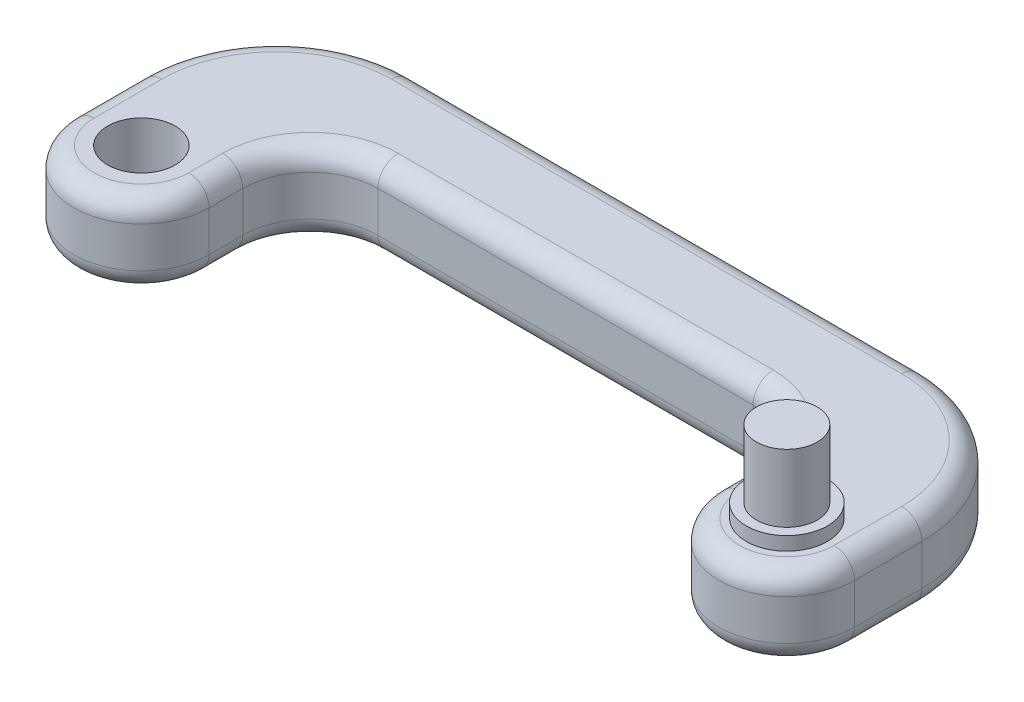
ISO-10303-21;
HEADER;
FILE_DESCRIPTION(('STEP AP214'),'2;1');
FILE_NAME('part.step','',(''),(''),'','','');
FILE_SCHEMA(('AUTOMOTIVE_DESIGN { 1 0 10303 214 1 1 1 1 }'));
ENDSEC;
DATA;
#1=APPLICATION_CONTEXT('core data for automotive mechanical design processes');
#2=APPLICATION_PROTOCOL_DEFINITION('international standard','automotive_design',2000,#1);
#3=PRODUCT_CONTEXT('',#1,'mechanical');
#4=PRODUCT('Part','Part','',(#3));
#5=PRODUCT_RELATED_PRODUCT_CATEGORY('part','',(#4));
#6=PRODUCT_DEFINITION_FORMATION('','',#4);
#7=PRODUCT_DEFINITION_CONTEXT('part definition',#1,'design');
#8=PRODUCT_DEFINITION('design','',#6,#7);
#9=PRODUCT_DEFINITION_SHAPE('','',#8);
#10=(LENGTH_UNIT() NAMED_UNIT(*) SI_UNIT(.MILLI.,.METRE.));
#11=(NAMED_UNIT(*) PLANE_ANGLE_UNIT() SI_UNIT($,.RADIAN.));
#12=(NAMED_UNIT(*) SI_UNIT($,.STERADIAN.) SOLID_ANGLE_UNIT());
#13=UNCERTAINTY_MEASURE_WITH_UNIT(LENGTH_MEASURE(1.E-05),#10,'distance_accuracy_value','');
#14=(GEOMETRIC_REPRESENTATION_CONTEXT(3) GLOBAL_UNCERTAINTY_ASSIGNED_CONTEXT((#13)) GLOBAL_UNIT_ASSIGNED_CONTEXT((#10,
#11,#12)) REPRESENTATION_CONTEXT('',''));
#15=CARTESIAN_POINT('',(0.,0.,0.));
#16=DIRECTION('',(0.,0.,1.));
#17=DIRECTION('',(1.,0.,0.));
#18=AXIS2_PLACEMENT_3D('',#15,#16,#17);
#19=CARTESIAN_POINT('',(-105.5,12.,0.));
#20=DIRECTION('',(-1.,0.,0.));
#21=DIRECTION('',(0.,0.,1.));
#22=AXIS2_PLACEMENT_3D('',#19,#20,#21);
#23=PLANE('',#22);
#24=DIRECTION('',(0.,-1.,0.));
#25=VECTOR('',#24,1.);
#26=CARTESIAN_POINT('',(-105.5,12.,0.));
#27=LINE('',#26,#25);
#28=CARTESIAN_POINT('',(-105.5,9.,0.));
#29=VERTEX_POINT('',#28);
#30=CARTESIAN_POINT('',(-105.5,3.,0.));
#31=VERTEX_POINT('',#30);
#32=EDGE_CURVE('E430',#29,#31,#27,.T.);
#33=ORIENTED_EDGE('',*,*,#32,.F.);
#34=DIRECTION('',(0.,0.,-1.));
#35=VECTOR('',#34,1.);
#36=CARTESIAN_POINT('',(-105.5,9.,0.));
#37=LINE('',#36,#35);
#38=CARTESIAN_POINT('',(-105.5,9.,-10.));
#39=VERTEX_POINT('',#38);
#40=EDGE_CURVE('E316',#29,#39,#37,.T.);
#41=ORIENTED_EDGE('',*,*,#40,.T.);
#42=DIRECTION('',(0.,-1.,0.));
#43=VECTOR('',#42,1.);
#44=CARTESIAN_POINT('',(-105.5,12.,-10.));
#45=LINE('',#44,#43);
#46=CARTESIAN_POINT('',(-105.5,3.,-10.));
#47=VERTEX_POINT('',#46);
#48=EDGE_CURVE('E238',#39,#47,#45,.T.);
#49=ORIENTED_EDGE('',*,*,#48,.T.);
#50=DIRECTION('',(0.,0.,-1.));
#51=VECTOR('',#50,1.);
#52=CARTESIAN_POINT('',(-105.5,3.,0.));
#53=LINE('',#52,#51);
#54=EDGE_CURVE('E313',#47,#31,#53,.F.);
#55=ORIENTED_EDGE('',*,*,#54,.T.);
#56=EDGE_LOOP('',(#33,#41,#49,#55));
#57=FACE_BOUND('',#56,.T.);
#58=ADVANCED_FACE('F36',(#57),#23,.T.);
#59=CARTESIAN_POINT('',(-95.5,12.,0.));
#60=DIRECTION('',(0.,-1.,0.));
#61=DIRECTION('',(0.,0.,-1.));
#62=AXIS2_PLACEMENT_3D('',#59,#60,#61);
#63=CYLINDRICAL_SURFACE('',#62,9.99999999999999);
#64=DIRECTION('',(0.,-1.,0.));
#65=VECTOR('',#64,1.);
#66=CARTESIAN_POINT('',(-85.5,12.,0.));
#67=LINE('',#66,#65);
#68=CARTESIAN_POINT('',(-85.5,9.,0.));
#69=VERTEX_POINT('',#68);
#70=CARTESIAN_POINT('',(-85.5,3.,0.));
#71=VERTEX_POINT('',#70);
#72=EDGE_CURVE('E426',#69,#71,#67,.T.);
#73=ORIENTED_EDGE('',*,*,#72,.F.);
#74=CARTESIAN_POINT('',(-95.5,9.,0.));
#75=DIRECTION('',(0.,1.,0.));
#76=DIRECTION('',(0.,0.,1.));
#77=AXIS2_PLACEMENT_3D('',#74,#75,#76);
#78=CIRCLE('',#77,9.99999999999999);
#79=EDGE_CURVE('E311',#69,#29,#78,.F.);
#80=ORIENTED_EDGE('',*,*,#79,.T.);
#81=ORIENTED_EDGE('',*,*,#32,.T.);
#82=CARTESIAN_POINT('',(-95.5,3.,0.));
#83=DIRECTION('',(0.,1.,0.));
#84=DIRECTION('',(0.,0.,1.));
#85=AXIS2_PLACEMENT_3D('',#82,#83,#84);
#86=CIRCLE('',#85,9.99999999999999);
#87=EDGE_CURVE('E309',#31,#71,#86,.T.);
#88=ORIENTED_EDGE('',*,*,#87,.T.);
#89=EDGE_LOOP('',(#73,#80,#81,#88));
#90=FACE_BOUND('',#89,.T.);
#91=ADVANCED_FACE('F473',(#90),#63,.T.);
#92=CARTESIAN_POINT('',(-85.5,12.,0.));
#93=DIRECTION('',(-1.,0.,0.));
#94=DIRECTION('',(0.,0.,1.));
#95=AXIS2_PLACEMENT_3D('',#92,#93,#94);
#96=PLANE('',#95);
#97=DIRECTION('',(0.,-1.,0.));
#98=VECTOR('',#97,1.);
#99=CARTESIAN_POINT('',(-85.5,12.,-5.));
#100=LINE('',#99,#98);
#101=CARTESIAN_POINT('',(-85.5,3.,-5.));
#102=VERTEX_POINT('',#101);
#103=CARTESIAN_POINT('',(-85.5,9.,-5.));
#104=VERTEX_POINT('',#103);
#105=EDGE_CURVE('E255',#102,#104,#100,.F.);
#106=ORIENTED_EDGE('',*,*,#105,.T.);
#107=DIRECTION('',(0.,0.,-1.));
#108=VECTOR('',#107,1.);
#109=CARTESIAN_POINT('',(-85.5,9.,0.));
#110=LINE('',#109,#108);
#111=EDGE_CURVE('E307',#104,#69,#110,.F.);
#112=ORIENTED_EDGE('',*,*,#111,.T.);
#113=ORIENTED_EDGE('',*,*,#72,.T.);
#114=DIRECTION('',(0.,0.,-1.));
#115=VECTOR('',#114,1.);
#116=CARTESIAN_POINT('',(-85.5,3.,0.));
#117=LINE('',#116,#115);
#118=EDGE_CURVE('E305',#71,#102,#117,.T.);
#119=ORIENTED_EDGE('',*,*,#118,.T.);
#120=EDGE_LOOP('',(#106,#112,#113,#119));
#121=FACE_BOUND('',#120,.T.);
#122=ADVANCED_FACE('F478',(#121),#96,.F.);
#123=CARTESIAN_POINT('',(0.,12.,-15.));
#124=DIRECTION('',(0.,0.,-1.));
#125=DIRECTION('',(-1.,0.,0.));
#126=AXIS2_PLACEMENT_3D('',#123,#124,#125);
#127=PLANE('',#126);
#128=DIRECTION('',(0.,-1.,0.));
#129=VECTOR('',#128,1.);
#130=CARTESIAN_POINT('',(-19.9999999999614,12.,-15.));
#131=LINE('',#130,#129);
#132=CARTESIAN_POINT('',(-19.9999999999614,3.,-15.));
#133=VERTEX_POINT('',#132);
#134=CARTESIAN_POINT('',(-19.9999999999614,9.,-15.));
#135=VERTEX_POINT('',#134);
#136=EDGE_CURVE('E252',#133,#135,#131,.F.);
#137=ORIENTED_EDGE('',*,*,#136,.T.);
#138=DIRECTION('',(1.,0.,0.));
#139=VECTOR('',#138,1.);
#140=CARTESIAN_POINT('',(-75.5,9.,-15.));
#141=LINE('',#140,#139);
#142=CARTESIAN_POINT('',(-75.5,9.,-15.));
#143=VERTEX_POINT('',#142);
#144=EDGE_CURVE('E299',#135,#143,#141,.F.);
#145=ORIENTED_EDGE('',*,*,#144,.T.);
#146=DIRECTION('',(0.,-1.,0.));
#147=VECTOR('',#146,1.);
#148=CARTESIAN_POINT('',(-75.5,0.,-15.));
#149=LINE('',#148,#147);
#150=CARTESIAN_POINT('',(-75.5,3.,-15.));
#151=VERTEX_POINT('',#150);
#152=EDGE_CURVE('E249',#143,#151,#149,.T.);
#153=ORIENTED_EDGE('',*,*,#152,.T.);
#154=DIRECTION('',(1.,0.,0.));
#155=VECTOR('',#154,1.);
#156=CARTESIAN_POINT('',(0.,3.,-15.));
#157=LINE('',#156,#155);
#158=EDGE_CURVE('E297',#151,#133,#157,.T.);
#159=ORIENTED_EDGE('',*,*,#158,.T.);
#160=EDGE_LOOP('',(#137,#145,#153,#159));
#161=FACE_BOUND('',#160,.T.);
#162=ADVANCED_FACE('F483',(#161),#127,.F.);
#163=CARTESIAN_POINT('',(-9.99999999996144,12.,0.));
#164=DIRECTION('',(-1.,0.,0.));
#165=DIRECTION('',(0.,0.,1.));
#166=AXIS2_PLACEMENT_3D('',#163,#164,#165);
#167=PLANE('',#166);
#168=DIRECTION('',(0.,-1.,0.));
#169=VECTOR('',#168,1.);
#170=CARTESIAN_POINT('',(-9.99999999996144,12.,0.));
#171=LINE('',#170,#169);
#172=CARTESIAN_POINT('',(-9.99999999996144,9.,0.));
#173=VERTEX_POINT('',#172);
#174=CARTESIAN_POINT('',(-9.99999999996144,3.,0.));
#175=VERTEX_POINT('',#174);
#176=EDGE_CURVE('E418',#173,#175,#171,.T.);
#177=ORIENTED_EDGE('',*,*,#176,.F.);
#178=DIRECTION('',(0.,0.,-1.));
#179=VECTOR('',#178,1.);
#180=CARTESIAN_POINT('',(-9.99999999996144,9.,0.));
#181=LINE('',#180,#179);
#182=CARTESIAN_POINT('',(-9.99999999996144,9.,-5.));
#183=VERTEX_POINT('',#182);
#184=EDGE_CURVE('E291',#173,#183,#181,.T.);
#185=ORIENTED_EDGE('',*,*,#184,.T.);
#186=DIRECTION('',(0.,-1.,0.));
#187=VECTOR('',#186,1.);
#188=CARTESIAN_POINT('',(-9.99999999996144,12.,-5.));
#189=LINE('',#188,#187);
#190=CARTESIAN_POINT('',(-9.99999999996144,3.,-5.));
#191=VERTEX_POINT('',#190);
#192=EDGE_CURVE('E246',#183,#191,#189,.T.);
#193=ORIENTED_EDGE('',*,*,#192,.T.);
#194=DIRECTION('',(0.,0.,-1.));
#195=VECTOR('',#194,1.);
#196=CARTESIAN_POINT('',(-9.99999999996144,3.,0.));
#197=LINE('',#196,#195);
#198=EDGE_CURVE('E289',#191,#175,#197,.F.);
#199=ORIENTED_EDGE('',*,*,#198,.T.);
#200=EDGE_LOOP('',(#177,#185,#193,#199));
#201=FACE_BOUND('',#200,.T.);
#202=ADVANCED_FACE('F417',(#201),#167,.T.);
#203=CARTESIAN_POINT('',(0.,12.,0.));
#204=DIRECTION('',(0.,-1.,0.));
#205=DIRECTION('',(0.,0.,-1.));
#206=AXIS2_PLACEMENT_3D('',#203,#204,#205);
#207=CYLINDRICAL_SURFACE('',#206,9.99999999996144);
#208=DIRECTION('',(0.,-1.,0.));
#209=VECTOR('',#208,1.);
#210=CARTESIAN_POINT('',(9.99999999996144,12.,0.));
#211=LINE('',#210,#209);
#212=CARTESIAN_POINT('',(9.99999999996144,9.,0.));
#213=VERTEX_POINT('',#212);
#214=CARTESIAN_POINT('',(9.99999999996144,3.,0.));
#215=VERTEX_POINT('',#214);
#216=EDGE_CURVE('E427',#213,#215,#211,.T.);
#217=ORIENTED_EDGE('',*,*,#216,.F.);
#218=CARTESIAN_POINT('',(0.,9.,0.));
#219=DIRECTION('',(0.,1.,0.));
#220=DIRECTION('',(0.,0.,1.));
#221=AXIS2_PLACEMENT_3D('',#218,#219,#220);
#222=CIRCLE('',#221,9.99999999996144);
#223=EDGE_CURVE('E287',#213,#173,#222,.F.);
#224=ORIENTED_EDGE('',*,*,#223,.T.);
#225=ORIENTED_EDGE('',*,*,#176,.T.);
#226=CARTESIAN_POINT('',(0.,3.,0.));
#227=DIRECTION('',(0.,1.,0.));
#228=DIRECTION('',(0.,0.,1.));
#229=AXIS2_PLACEMENT_3D('',#226,#227,#228);
#230=CIRCLE('',#229,9.99999999996144);
#231=EDGE_CURVE('E285',#175,#215,#230,.T.);
#232=ORIENTED_EDGE('',*,*,#231,.T.);
#233=EDGE_LOOP('',(#217,#224,#225,#232));
#234=FACE_BOUND('',#233,.T.);
#235=ADVANCED_FACE('F423',(#234),#207,.T.);
#236=CARTESIAN_POINT('',(9.99999999996144,12.,0.));
#237=DIRECTION('',(-1.,0.,0.));
#238=DIRECTION('',(0.,0.,1.));
#239=AXIS2_PLACEMENT_3D('',#236,#237,#238);
#240=PLANE('',#239);
#241=DIRECTION('',(0.,-1.,0.));
#242=VECTOR('',#241,1.);
#243=CARTESIAN_POINT('',(9.99999999996144,12.,-10.));
#244=LINE('',#243,#242);
#245=CARTESIAN_POINT('',(9.99999999996144,3.,-10.));
#246=VERTEX_POINT('',#245);
#247=CARTESIAN_POINT('',(9.99999999996144,9.,-10.));
#248=VERTEX_POINT('',#247);
#249=EDGE_CURVE('E236',#246,#248,#244,.F.);
#250=ORIENTED_EDGE('',*,*,#249,.T.);
#251=DIRECTION('',(0.,0.,-1.));
#252=VECTOR('',#251,1.);
#253=CARTESIAN_POINT('',(9.99999999996144,9.,0.));
#254=LINE('',#253,#252);
#255=EDGE_CURVE('E283',#248,#213,#254,.F.);
#256=ORIENTED_EDGE('',*,*,#255,.T.);
#257=ORIENTED_EDGE('',*,*,#216,.T.);
#258=DIRECTION('',(0.,0.,-1.));
#259=VECTOR('',#258,1.);
#260=CARTESIAN_POINT('',(9.99999999996144,3.,0.));
#261=LINE('',#260,#259);
#262=EDGE_CURVE('E219',#215,#246,#261,.T.);
#263=ORIENTED_EDGE('',*,*,#262,.T.);
#264=EDGE_LOOP('',(#250,#256,#257,#263));
#265=FACE_BOUND('',#264,.T.);
#266=ADVANCED_FACE('F459',(#265),#240,.F.);
#267=CARTESIAN_POINT('',(-95.5,12.,0.));
#268=DIRECTION('',(0.,-1.,0.));
#269=DIRECTION('',(0.,0.,-1.));
#270=AXIS2_PLACEMENT_3D('',#267,#268,#269);
#271=CYLINDRICAL_SURFACE('',#270,5.);
#272=CARTESIAN_POINT('',(-95.5,12.,0.));
#273=DIRECTION('',(0.,1.,0.));
#274=DIRECTION('',(0.,0.,1.));
#275=AXIS2_PLACEMENT_3D('',#272,#273,#274);
#276=CIRCLE('',#275,5.);
#277=CARTESIAN_POINT('',(-95.5,12.,5.00000000000002));
#278=VERTEX_POINT('',#277);
#279=EDGE_CURVE('E432',#278,#278,#276,.T.);
#280=ORIENTED_EDGE('',*,*,#279,.T.);
#281=EDGE_LOOP('',(#280));
#282=FACE_BOUND('',#281,.T.);
#283=CARTESIAN_POINT('',(-95.5,0.,0.));
#284=DIRECTION('',(0.,1.,0.));
#285=DIRECTION('',(0.,0.,1.));
#286=AXIS2_PLACEMENT_3D('',#283,#284,#285);
#287=CIRCLE('',#286,5.);
#288=CARTESIAN_POINT('',(-95.5,0.,5.00000000000002));
#289=VERTEX_POINT('',#288);
#290=EDGE_CURVE('E447',#289,#289,#287,.T.);
#291=ORIENTED_EDGE('',*,*,#290,.F.);
#292=EDGE_LOOP('',(#291));
#293=FACE_BOUND('',#292,.T.);
#294=ADVANCED_FACE('F457',(#282,#293),#271,.F.);
#295=CARTESIAN_POINT('',(0.,12.,-30.));
#296=DIRECTION('',(0.,0.,-1.));
#297=DIRECTION('',(-1.,0.,0.));
#298=AXIS2_PLACEMENT_3D('',#295,#296,#297);
#299=PLANE('',#298);
#300=DIRECTION('',(0.,-1.,0.));
#301=VECTOR('',#300,1.);
#302=CARTESIAN_POINT('',(-85.5,12.,-30.));
#303=LINE('',#302,#301);
#304=CARTESIAN_POINT('',(-85.5,3.,-30.));
#305=VERTEX_POINT('',#304);
#306=CARTESIAN_POINT('',(-85.5,9.,-30.));
#307=VERTEX_POINT('',#306);
#308=EDGE_CURVE('E229',#305,#307,#303,.F.);
#309=ORIENTED_EDGE('',*,*,#308,.T.);
#310=DIRECTION('',(1.,0.,0.));
#311=VECTOR('',#310,1.);
#312=CARTESIAN_POINT('',(0.,9.,-30.));
#313=LINE('',#312,#311);
#314=CARTESIAN_POINT('',(-10.0000000000386,9.,-30.));
#315=VERTEX_POINT('',#314);
#316=EDGE_CURVE('E203',#307,#315,#313,.T.);
#317=ORIENTED_EDGE('',*,*,#316,.T.);
#318=DIRECTION('',(0.,-1.,0.));
#319=VECTOR('',#318,1.);
#320=CARTESIAN_POINT('',(-10.0000000000386,0.,-30.));
#321=LINE('',#320,#319);
#322=CARTESIAN_POINT('',(-10.0000000000386,3.,-30.));
#323=VERTEX_POINT('',#322);
#324=EDGE_CURVE('E226',#315,#323,#321,.T.);
#325=ORIENTED_EDGE('',*,*,#324,.T.);
#326=DIRECTION('',(1.,0.,0.));
#327=VECTOR('',#326,1.);
#328=CARTESIAN_POINT('',(-85.5,3.,-30.));
#329=LINE('',#328,#327);
#330=EDGE_CURVE('E232',#323,#305,#329,.F.);
#331=ORIENTED_EDGE('',*,*,#330,.T.);
#332=EDGE_LOOP('',(#309,#317,#325,#331));
#333=FACE_BOUND('',#332,.T.);
#334=ADVANCED_FACE('F225',(#333),#299,.T.);
#335=CARTESIAN_POINT('',(0.,12.,0.));
#336=DIRECTION('',(0.,1.,0.));
#337=DIRECTION('',(0.,0.,1.));
#338=AXIS2_PLACEMENT_3D('',#335,#336,#337);
#339=PLANE('',#338);
#340=CARTESIAN_POINT('',(-10.0000000000386,12.,-10.));
#341=DIRECTION('',(0.,1.,0.));
#342=DIRECTION('',(0.,0.,1.));
#343=AXIS2_PLACEMENT_3D('',#340,#341,#342);
#344=CIRCLE('',#343,17.);
#345=CARTESIAN_POINT('',(6.99999999996144,12.,-10.));
#346=VERTEX_POINT('',#345);
#347=CARTESIAN_POINT('',(-10.0000000000386,12.,-27.));
#348=VERTEX_POINT('',#347);
#349=EDGE_CURVE('E278',#346,#348,#344,.T.);
#350=ORIENTED_EDGE('',*,*,#349,.T.);
#351=DIRECTION('',(1.,0.,0.));
#352=VECTOR('',#351,1.);
#353=CARTESIAN_POINT('',(0.,12.,-27.));
#354=LINE('',#353,#352);
#355=CARTESIAN_POINT('',(-85.5,12.,-27.));
#356=VERTEX_POINT('',#355);
#357=EDGE_CURVE('E205',#348,#356,#354,.F.);
#358=ORIENTED_EDGE('',*,*,#357,.T.);
#359=CARTESIAN_POINT('',(-85.5,12.,-10.));
#360=DIRECTION('',(0.,1.,0.));
#361=DIRECTION('',(0.,0.,1.));
#362=AXIS2_PLACEMENT_3D('',#359,#360,#361);
#363=CIRCLE('',#362,17.);
#364=CARTESIAN_POINT('',(-102.5,12.,-10.));
#365=VERTEX_POINT('',#364);
#366=EDGE_CURVE('E231',#356,#365,#363,.T.);
#367=ORIENTED_EDGE('',*,*,#366,.T.);
#368=DIRECTION('',(0.,0.,-1.));
#369=VECTOR('',#368,1.);
#370=CARTESIAN_POINT('',(-102.5,12.,0.));
#371=LINE('',#370,#369);
#372=CARTESIAN_POINT('',(-102.5,12.,0.));
#373=VERTEX_POINT('',#372);
#374=EDGE_CURVE('E260',#365,#373,#371,.F.);
#375=ORIENTED_EDGE('',*,*,#374,.T.);
#376=CARTESIAN_POINT('',(-95.5,12.,0.));
#377=DIRECTION('',(0.,1.,0.));
#378=DIRECTION('',(0.,0.,1.));
#379=AXIS2_PLACEMENT_3D('',#376,#377,#378);
#380=CIRCLE('',#379,6.99999999999999);
#381=CARTESIAN_POINT('',(-88.5,12.,0.));
#382=VERTEX_POINT('',#381);
#383=EDGE_CURVE('E262',#373,#382,#380,.T.);
#384=ORIENTED_EDGE('',*,*,#383,.T.);
#385=DIRECTION('',(0.,0.,-1.));
#386=VECTOR('',#385,1.);
#387=CARTESIAN_POINT('',(-88.5,12.,-5.));
#388=LINE('',#387,#386);
#389=CARTESIAN_POINT('',(-88.5,12.,-5.));
#390=VERTEX_POINT('',#389);
#391=EDGE_CURVE('E264',#382,#390,#388,.T.);
#392=ORIENTED_EDGE('',*,*,#391,.T.);
#393=CARTESIAN_POINT('',(-75.5,12.,-5.));
#394=DIRECTION('',(0.,1.,0.));
#395=DIRECTION('',(0.,0.,1.));
#396=AXIS2_PLACEMENT_3D('',#393,#394,#395);
#397=CIRCLE('',#396,13.);
#398=CARTESIAN_POINT('',(-75.5,12.,-18.));
#399=VERTEX_POINT('',#398);
#400=EDGE_CURVE('E266',#390,#399,#397,.F.);
#401=ORIENTED_EDGE('',*,*,#400,.T.);
#402=DIRECTION('',(1.,0.,0.));
#403=VECTOR('',#402,1.);
#404=CARTESIAN_POINT('',(-19.9999999999614,12.,-18.));
#405=LINE('',#404,#403);
#406=CARTESIAN_POINT('',(-19.9999999999614,12.,-18.));
#407=VERTEX_POINT('',#406);
#408=EDGE_CURVE('E268',#399,#407,#405,.T.);
#409=ORIENTED_EDGE('',*,*,#408,.T.);
#410=CARTESIAN_POINT('',(-19.9999999999614,12.,-5.));
#411=DIRECTION('',(0.,1.,0.));
#412=DIRECTION('',(0.,0.,1.));
#413=AXIS2_PLACEMENT_3D('',#410,#411,#412);
#414=CIRCLE('',#413,13.);
#415=CARTESIAN_POINT('',(-6.99999999996144,12.,-5.));
#416=VERTEX_POINT('',#415);
#417=EDGE_CURVE('E270',#407,#416,#414,.F.);
#418=ORIENTED_EDGE('',*,*,#417,.T.);
#419=DIRECTION('',(0.,0.,-1.));
#420=VECTOR('',#419,1.);
#421=CARTESIAN_POINT('',(-6.99999999996144,12.,0.));
#422=LINE('',#421,#420);
#423=CARTESIAN_POINT('',(-6.99999999996144,12.,0.));
#424=VERTEX_POINT('',#423);
#425=EDGE_CURVE('E272',#416,#424,#422,.F.);
#426=ORIENTED_EDGE('',*,*,#425,.T.);
#427=CARTESIAN_POINT('',(0.,12.,0.));
#428=DIRECTION('',(0.,1.,0.));
#429=DIRECTION('',(0.,0.,1.));
#430=AXIS2_PLACEMENT_3D('',#427,#428,#429);
#431=CIRCLE('',#430,6.99999999996144);
#432=CARTESIAN_POINT('',(6.99999999996144,12.,0.));
#433=VERTEX_POINT('',#432);
#434=EDGE_CURVE('E274',#424,#433,#431,.T.);
#435=ORIENTED_EDGE('',*,*,#434,.T.);
#436=DIRECTION('',(0.,0.,-1.));
#437=VECTOR('',#436,1.);
#438=CARTESIAN_POINT('',(6.99999999996144,12.,-10.));
#439=LINE('',#438,#437);
#440=EDGE_CURVE('E276',#433,#346,#439,.T.);
#441=ORIENTED_EDGE('',*,*,#440,.T.);
#442=EDGE_LOOP('',(#350,#358,#367,#375,#384,#392,#401,#409,#418,#426,#435,#441));
#443=FACE_BOUND('',#442,.T.);
#444=CARTESIAN_POINT('',(0.,12.,0.));
#445=DIRECTION('',(0.,1.,0.));
#446=DIRECTION('',(0.,0.,1.));
#447=AXIS2_PLACEMENT_3D('',#444,#445,#446);
#448=CIRCLE('',#447,6.);
#449=CARTESIAN_POINT('',(0.,12.,6.));
#450=VERTEX_POINT('',#449);
#451=EDGE_CURVE('E448',#450,#450,#448,.T.);
#452=ORIENTED_EDGE('',*,*,#451,.F.);
#453=EDGE_LOOP('',(#452));
#454=FACE_BOUND('',#453,.T.);
#455=ORIENTED_EDGE('',*,*,#279,.F.);
#456=EDGE_LOOP('',(#455));
#457=FACE_BOUND('',#456,.T.);
#458=ADVANCED_FACE('F466',(#443,#454,#457),#339,.T.);
#459=CARTESIAN_POINT('',(0.,0.,0.));
#460=DIRECTION('',(0.,1.,0.));
#461=DIRECTION('',(0.,0.,1.));
#462=AXIS2_PLACEMENT_3D('',#459,#460,#461);
#463=PLANE('',#462);
#464=CARTESIAN_POINT('',(-95.5,0.,0.));
#465=DIRECTION('',(0.,1.,0.));
#466=DIRECTION('',(0.,0.,1.));
#467=AXIS2_PLACEMENT_3D('',#464,#465,#466);
#468=CIRCLE('',#467,6.99999999999999);
#469=CARTESIAN_POINT('',(-88.5,0.,0.));
#470=VERTEX_POINT('',#469);
#471=CARTESIAN_POINT('',(-102.5,0.,0.));
#472=VERTEX_POINT('',#471);
#473=EDGE_CURVE('E53',#470,#472,#468,.F.);
#474=ORIENTED_EDGE('',*,*,#473,.T.);
#475=DIRECTION('',(0.,0.,-1.));
#476=VECTOR('',#475,1.);
#477=CARTESIAN_POINT('',(-102.5,0.,-10.));
#478=LINE('',#477,#476);
#479=CARTESIAN_POINT('',(-102.5,0.,-10.));
#480=VERTEX_POINT('',#479);
#481=EDGE_CURVE('E338',#472,#480,#478,.T.);
#482=ORIENTED_EDGE('',*,*,#481,.T.);
#483=CARTESIAN_POINT('',(-85.5,0.,-10.));
#484=DIRECTION('',(0.,1.,0.));
#485=DIRECTION('',(0.,0.,1.));
#486=AXIS2_PLACEMENT_3D('',#483,#484,#485);
#487=CIRCLE('',#486,17.);
#488=CARTESIAN_POINT('',(-85.5,0.,-27.));
#489=VERTEX_POINT('',#488);
#490=EDGE_CURVE('E318',#480,#489,#487,.F.);
#491=ORIENTED_EDGE('',*,*,#490,.T.);
#492=DIRECTION('',(1.,0.,0.));
#493=VECTOR('',#492,1.);
#494=CARTESIAN_POINT('',(-10.0000000000386,0.,-27.));
#495=LINE('',#494,#493);
#496=CARTESIAN_POINT('',(-10.0000000000386,0.,-27.));
#497=VERTEX_POINT('',#496);
#498=EDGE_CURVE('E320',#489,#497,#495,.T.);
#499=ORIENTED_EDGE('',*,*,#498,.T.);
#500=CARTESIAN_POINT('',(-10.0000000000386,0.,-10.));
#501=DIRECTION('',(0.,1.,0.));
#502=DIRECTION('',(0.,0.,1.));
#503=AXIS2_PLACEMENT_3D('',#500,#501,#502);
#504=CIRCLE('',#503,17.);
#505=CARTESIAN_POINT('',(6.99999999996144,0.,-10.));
#506=VERTEX_POINT('',#505);
#507=EDGE_CURVE('E322',#497,#506,#504,.F.);
#508=ORIENTED_EDGE('',*,*,#507,.T.);
#509=DIRECTION('',(0.,0.,-1.));
#510=VECTOR('',#509,1.);
#511=CARTESIAN_POINT('',(6.99999999996144,0.,0.));
#512=LINE('',#511,#510);
#513=CARTESIAN_POINT('',(6.99999999996144,0.,0.));
#514=VERTEX_POINT('',#513);
#515=EDGE_CURVE('E324',#506,#514,#512,.F.);
#516=ORIENTED_EDGE('',*,*,#515,.T.);
#517=CARTESIAN_POINT('',(0.,0.,0.));
#518=DIRECTION('',(0.,1.,0.));
#519=DIRECTION('',(0.,0.,1.));
#520=AXIS2_PLACEMENT_3D('',#517,#518,#519);
#521=CIRCLE('',#520,6.99999999996144);
#522=CARTESIAN_POINT('',(-6.99999999996144,0.,0.));
#523=VERTEX_POINT('',#522);
#524=EDGE_CURVE('E326',#514,#523,#521,.F.);
#525=ORIENTED_EDGE('',*,*,#524,.T.);
#526=DIRECTION('',(0.,0.,-1.));
#527=VECTOR('',#526,1.);
#528=CARTESIAN_POINT('',(-6.99999999996144,0.,-5.));
#529=LINE('',#528,#527);
#530=CARTESIAN_POINT('',(-6.99999999996144,0.,-5.));
#531=VERTEX_POINT('',#530);
#532=EDGE_CURVE('E328',#523,#531,#529,.T.);
#533=ORIENTED_EDGE('',*,*,#532,.T.);
#534=CARTESIAN_POINT('',(-19.9999999999614,0.,-5.));
#535=DIRECTION('',(0.,1.,0.));
#536=DIRECTION('',(0.,0.,1.));
#537=AXIS2_PLACEMENT_3D('',#534,#535,#536);
#538=CIRCLE('',#537,13.);
#539=CARTESIAN_POINT('',(-19.9999999999614,0.,-18.));
#540=VERTEX_POINT('',#539);
#541=EDGE_CURVE('E330',#531,#540,#538,.T.);
#542=ORIENTED_EDGE('',*,*,#541,.T.);
#543=DIRECTION('',(1.,0.,0.));
#544=VECTOR('',#543,1.);
#545=CARTESIAN_POINT('',(0.,0.,-18.));
#546=LINE('',#545,#544);
#547=CARTESIAN_POINT('',(-75.5,0.,-18.));
#548=VERTEX_POINT('',#547);
#549=EDGE_CURVE('E332',#540,#548,#546,.F.);
#550=ORIENTED_EDGE('',*,*,#549,.T.);
#551=CARTESIAN_POINT('',(-75.5,0.,-5.));
#552=DIRECTION('',(0.,1.,0.));
#553=DIRECTION('',(0.,0.,1.));
#554=AXIS2_PLACEMENT_3D('',#551,#552,#553);
#555=CIRCLE('',#554,13.);
#556=CARTESIAN_POINT('',(-88.5,0.,-5.));
#557=VERTEX_POINT('',#556);
#558=EDGE_CURVE('E334',#548,#557,#555,.T.);
#559=ORIENTED_EDGE('',*,*,#558,.T.);
#560=DIRECTION('',(0.,0.,-1.));
#561=VECTOR('',#560,1.);
#562=CARTESIAN_POINT('',(-88.5,0.,0.));
#563=LINE('',#562,#561);
#564=EDGE_CURVE('E58',#557,#470,#563,.F.);
#565=ORIENTED_EDGE('',*,*,#564,.T.);
#566=EDGE_LOOP('',(#474,#482,#491,#499,#508,#516,#525,#533,#542,#550,#559,#565));
#567=FACE_BOUND('',#566,.T.);
#568=ORIENTED_EDGE('',*,*,#290,.T.);
#569=EDGE_LOOP('',(#568));
#570=FACE_BOUND('',#569,.T.);
#571=ADVANCED_FACE('F455',(#567,#570),#463,.F.);
#572=CARTESIAN_POINT('',(0.,14.,0.));
#573=DIRECTION('',(0.,-1.,0.));
#574=DIRECTION('',(0.,0.,-1.));
#575=AXIS2_PLACEMENT_3D('',#572,#573,#574);
#576=CYLINDRICAL_SURFACE('',#575,6.);
#577=CARTESIAN_POINT('',(0.,14.,0.));
#578=DIRECTION('',(0.,1.,0.));
#579=DIRECTION('',(0.,0.,1.));
#580=AXIS2_PLACEMENT_3D('',#577,#578,#579);
#581=CIRCLE('',#580,6.);
#582=CARTESIAN_POINT('',(0.,14.,6.));
#583=VERTEX_POINT('',#582);
#584=EDGE_CURVE('E444',#583,#583,#581,.T.);
#585=ORIENTED_EDGE('',*,*,#584,.F.);
#586=EDGE_LOOP('',(#585));
#587=FACE_BOUND('',#586,.T.);
#588=ORIENTED_EDGE('',*,*,#451,.T.);
#589=EDGE_LOOP('',(#588));
#590=FACE_BOUND('',#589,.T.);
#591=ADVANCED_FACE('F494',(#587,#590),#576,.T.);
#592=CARTESIAN_POINT('',(0.,14.,0.));
#593=DIRECTION('',(0.,1.,0.));
#594=DIRECTION('',(0.,0.,1.));
#595=AXIS2_PLACEMENT_3D('',#592,#593,#594);
#596=PLANE('',#595);
#597=CARTESIAN_POINT('',(0.,14.,0.));
#598=DIRECTION('',(0.,1.,0.));
#599=DIRECTION('',(0.,0.,1.));
#600=AXIS2_PLACEMENT_3D('',#597,#598,#599);
#601=CIRCLE('',#600,4.5);
#602=CARTESIAN_POINT('',(0.,14.,4.5));
#603=VERTEX_POINT('',#602);
#604=EDGE_CURVE('E240',#603,#603,#601,.T.);
#605=ORIENTED_EDGE('',*,*,#604,.F.);
#606=EDGE_LOOP('',(#605));
#607=FACE_BOUND('',#606,.T.);
#608=ORIENTED_EDGE('',*,*,#584,.T.);
#609=EDGE_LOOP('',(#608));
#610=FACE_BOUND('',#609,.T.);
#611=ADVANCED_FACE('F500',(#607,#610),#596,.T.);
#612=CARTESIAN_POINT('',(0.,24.,0.));
#613=DIRECTION('',(0.,-1.,0.));
#614=DIRECTION('',(0.,0.,-1.));
#615=AXIS2_PLACEMENT_3D('',#612,#613,#614);
#616=CYLINDRICAL_SURFACE('',#615,4.5);
#617=CARTESIAN_POINT('',(0.,24.,0.));
#618=DIRECTION('',(0.,1.,0.));
#619=DIRECTION('',(0.,0.,1.));
#620=AXIS2_PLACEMENT_3D('',#617,#618,#619);
#621=CIRCLE('',#620,4.5);
#622=CARTESIAN_POINT('',(0.,24.,4.5));
#623=VERTEX_POINT('',#622);
#624=EDGE_CURVE('E370',#623,#623,#621,.T.);
#625=ORIENTED_EDGE('',*,*,#624,.F.);
#626=EDGE_LOOP('',(#625));
#627=FACE_BOUND('',#626,.T.);
#628=ORIENTED_EDGE('',*,*,#604,.T.);
#629=EDGE_LOOP('',(#628));
#630=FACE_BOUND('',#629,.T.);
#631=ADVANCED_FACE('F504',(#627,#630),#616,.T.);
#632=CARTESIAN_POINT('',(0.,24.,0.));
#633=DIRECTION('',(0.,1.,0.));
#634=DIRECTION('',(0.,0.,1.));
#635=AXIS2_PLACEMENT_3D('',#632,#633,#634);
#636=PLANE('',#635);
#637=ORIENTED_EDGE('',*,*,#624,.T.);
#638=EDGE_LOOP('',(#637));
#639=FACE_BOUND('',#638,.T.);
#640=ADVANCED_FACE('F508',(#639),#636,.T.);
#641=CARTESIAN_POINT('',(-10.0000000000386,12.,-10.));
#642=DIRECTION('',(0.,1.,0.));
#643=DIRECTION('',(0.,0.,1.));
#644=AXIS2_PLACEMENT_3D('',#641,#642,#643);
#645=CYLINDRICAL_SURFACE('',#644,20.);
#646=ORIENTED_EDGE('',*,*,#324,.F.);
#647=CARTESIAN_POINT('',(-10.0000000000386,9.,-10.));
#648=DIRECTION('',(0.,1.,0.));
#649=DIRECTION('',(0.,0.,1.));
#650=AXIS2_PLACEMENT_3D('',#647,#648,#649);
#651=CIRCLE('',#650,20.);
#652=EDGE_CURVE('E211',#315,#248,#651,.F.);
#653=ORIENTED_EDGE('',*,*,#652,.T.);
#654=ORIENTED_EDGE('',*,*,#249,.F.);
#655=CARTESIAN_POINT('',(-10.0000000000386,3.,-10.));
#656=DIRECTION('',(0.,1.,0.));
#657=DIRECTION('',(0.,0.,1.));
#658=AXIS2_PLACEMENT_3D('',#655,#656,#657);
#659=CIRCLE('',#658,20.);
#660=EDGE_CURVE('E220',#246,#323,#659,.T.);
#661=ORIENTED_EDGE('',*,*,#660,.T.);
#662=EDGE_LOOP('',(#646,#653,#654,#661));
#663=FACE_BOUND('',#662,.T.);
#664=ADVANCED_FACE('F234',(#663),#645,.T.);
#665=CARTESIAN_POINT('',(-85.5,12.,-10.));
#666=DIRECTION('',(0.,-1.,0.));
#667=DIRECTION('',(0.,0.,-1.));
#668=AXIS2_PLACEMENT_3D('',#665,#666,#667);
#669=CYLINDRICAL_SURFACE('',#668,20.);
#670=ORIENTED_EDGE('',*,*,#48,.F.);
#671=CARTESIAN_POINT('',(-85.5,9.,-10.));
#672=DIRECTION('',(0.,1.,0.));
#673=DIRECTION('',(0.,0.,1.));
#674=AXIS2_PLACEMENT_3D('',#671,#672,#673);
#675=CIRCLE('',#674,20.);
#676=EDGE_CURVE('E11',#39,#307,#675,.F.);
#677=ORIENTED_EDGE('',*,*,#676,.T.);
#678=ORIENTED_EDGE('',*,*,#308,.F.);
#679=CARTESIAN_POINT('',(-85.5,3.,-10.));
#680=DIRECTION('',(0.,1.,0.));
#681=DIRECTION('',(0.,0.,1.));
#682=AXIS2_PLACEMENT_3D('',#679,#680,#681);
#683=CIRCLE('',#682,20.);
#684=EDGE_CURVE('E45',#305,#47,#683,.T.);
#685=ORIENTED_EDGE('',*,*,#684,.T.);
#686=EDGE_LOOP('',(#670,#677,#678,#685));
#687=FACE_BOUND('',#686,.T.);
#688=ADVANCED_FACE('F515',(#687),#669,.T.);
#689=CARTESIAN_POINT('',(-19.9999999999614,12.,-5.));
#690=DIRECTION('',(0.,-1.,0.));
#691=DIRECTION('',(0.,0.,-1.));
#692=AXIS2_PLACEMENT_3D('',#689,#690,#691);
#693=CYLINDRICAL_SURFACE('',#692,10.);
#694=ORIENTED_EDGE('',*,*,#192,.F.);
#695=CARTESIAN_POINT('',(-19.9999999999614,9.,-5.));
#696=DIRECTION('',(0.,1.,0.));
#697=DIRECTION('',(0.,0.,1.));
#698=AXIS2_PLACEMENT_3D('',#695,#696,#697);
#699=CIRCLE('',#698,10.);
#700=EDGE_CURVE('E295',#183,#135,#699,.T.);
#701=ORIENTED_EDGE('',*,*,#700,.T.);
#702=ORIENTED_EDGE('',*,*,#136,.F.);
#703=CARTESIAN_POINT('',(-19.9999999999614,3.,-5.));
#704=DIRECTION('',(0.,1.,0.));
#705=DIRECTION('',(0.,0.,1.));
#706=AXIS2_PLACEMENT_3D('',#703,#704,#705);
#707=CIRCLE('',#706,10.);
#708=EDGE_CURVE('E293',#133,#191,#707,.F.);
#709=ORIENTED_EDGE('',*,*,#708,.T.);
#710=EDGE_LOOP('',(#694,#701,#702,#709));
#711=FACE_BOUND('',#710,.T.);
#712=ADVANCED_FACE('F521',(#711),#693,.F.);
#713=CARTESIAN_POINT('',(-75.5,12.,-5.));
#714=DIRECTION('',(0.,1.,0.));
#715=DIRECTION('',(0.,0.,1.));
#716=AXIS2_PLACEMENT_3D('',#713,#714,#715);
#717=CYLINDRICAL_SURFACE('',#716,10.);
#718=ORIENTED_EDGE('',*,*,#152,.F.);
#719=CARTESIAN_POINT('',(-75.5,9.,-5.));
#720=DIRECTION('',(0.,1.,0.));
#721=DIRECTION('',(0.,0.,1.));
#722=AXIS2_PLACEMENT_3D('',#719,#720,#721);
#723=CIRCLE('',#722,10.);
#724=EDGE_CURVE('E303',#143,#104,#723,.T.);
#725=ORIENTED_EDGE('',*,*,#724,.T.);
#726=ORIENTED_EDGE('',*,*,#105,.F.);
#727=CARTESIAN_POINT('',(-75.5,3.,-5.));
#728=DIRECTION('',(0.,1.,0.));
#729=DIRECTION('',(0.,0.,1.));
#730=AXIS2_PLACEMENT_3D('',#727,#728,#729);
#731=CIRCLE('',#730,10.);
#732=EDGE_CURVE('E301',#102,#151,#731,.F.);
#733=ORIENTED_EDGE('',*,*,#732,.T.);
#734=EDGE_LOOP('',(#718,#725,#726,#733));
#735=FACE_BOUND('',#734,.T.);
#736=ADVANCED_FACE('F527',(#735),#717,.F.);
#737=CARTESIAN_POINT('',(0.,9.,-18.));
#738=DIRECTION('',(-1.,0.,0.));
#739=DIRECTION('',(0.,0.,1.));
#740=AXIS2_PLACEMENT_3D('',#737,#738,#739);
#741=CYLINDRICAL_SURFACE('',#740,3.);
#742=CARTESIAN_POINT('',(-19.9999999999614,9.,-18.));
#743=DIRECTION('',(1.,0.,0.));
#744=DIRECTION('',(0.,0.,-1.));
#745=AXIS2_PLACEMENT_3D('',#742,#743,#744);
#746=CIRCLE('',#745,3.);
#747=EDGE_CURVE('E364',#407,#135,#746,.T.);
#748=ORIENTED_EDGE('',*,*,#747,.F.);
#749=ORIENTED_EDGE('',*,*,#408,.F.);
#750=CARTESIAN_POINT('',(-75.5,9.,-18.));
#751=DIRECTION('',(-1.,0.,0.));
#752=DIRECTION('',(0.,0.,1.));
#753=AXIS2_PLACEMENT_3D('',#750,#751,#752);
#754=CIRCLE('',#753,3.);
#755=EDGE_CURVE('E367',#143,#399,#754,.T.);
#756=ORIENTED_EDGE('',*,*,#755,.F.);
#757=ORIENTED_EDGE('',*,*,#144,.F.);
#758=EDGE_LOOP('',(#748,#749,#756,#757));
#759=FACE_BOUND('',#758,.T.);
#760=ADVANCED_FACE('F531',(#759),#741,.T.);
#761=CARTESIAN_POINT('',(-75.5,9.,-5.));
#762=DIRECTION('',(0.,1.,0.));
#763=DIRECTION('',(0.,0.,1.));
#764=AXIS2_PLACEMENT_3D('',#761,#762,#763);
#765=TOROIDAL_SURFACE('',#764,13.,3.);
#766=ORIENTED_EDGE('',*,*,#755,.T.);
#767=ORIENTED_EDGE('',*,*,#400,.F.);
#768=CARTESIAN_POINT('',(-88.5,9.,-5.));
#769=DIRECTION('',(0.,0.,1.));
#770=DIRECTION('',(1.,0.,0.));
#771=AXIS2_PLACEMENT_3D('',#768,#769,#770);
#772=CIRCLE('',#771,3.);
#773=EDGE_CURVE('E361',#104,#390,#772,.T.);
#774=ORIENTED_EDGE('',*,*,#773,.F.);
#775=ORIENTED_EDGE('',*,*,#724,.F.);
#776=EDGE_LOOP('',(#766,#767,#774,#775));
#777=FACE_BOUND('',#776,.T.);
#778=ADVANCED_FACE('F568',(#777),#765,.T.);
#779=CARTESIAN_POINT('',(-19.9999999999614,9.,-5.));
#780=DIRECTION('',(0.,1.,0.));
#781=DIRECTION('',(0.,0.,1.));
#782=AXIS2_PLACEMENT_3D('',#779,#780,#781);
#783=TOROIDAL_SURFACE('',#782,13.,3.);
#784=ORIENTED_EDGE('',*,*,#747,.T.);
#785=ORIENTED_EDGE('',*,*,#700,.F.);
#786=CARTESIAN_POINT('',(-6.99999999996144,9.,-5.));
#787=DIRECTION('',(0.,0.,1.));
#788=DIRECTION('',(1.,0.,0.));
#789=AXIS2_PLACEMENT_3D('',#786,#787,#788);
#790=CIRCLE('',#789,3.);
#791=EDGE_CURVE('E358',#416,#183,#790,.T.);
#792=ORIENTED_EDGE('',*,*,#791,.F.);
#793=ORIENTED_EDGE('',*,*,#417,.F.);
#794=EDGE_LOOP('',(#784,#785,#792,#793));
#795=FACE_BOUND('',#794,.T.);
#796=ADVANCED_FACE('F564',(#795),#783,.T.);
#797=CARTESIAN_POINT('',(-88.5,9.,0.));
#798=DIRECTION('',(0.,0.,1.));
#799=DIRECTION('',(1.,0.,0.));
#800=AXIS2_PLACEMENT_3D('',#797,#798,#799);
#801=CYLINDRICAL_SURFACE('',#800,3.);
#802=ORIENTED_EDGE('',*,*,#773,.T.);
#803=ORIENTED_EDGE('',*,*,#391,.F.);
#804=CARTESIAN_POINT('',(-88.5,9.,0.));
#805=DIRECTION('',(0.,0.,1.));
#806=DIRECTION('',(1.,0.,0.));
#807=AXIS2_PLACEMENT_3D('',#804,#805,#806);
#808=CIRCLE('',#807,3.);
#809=EDGE_CURVE('E355',#69,#382,#808,.T.);
#810=ORIENTED_EDGE('',*,*,#809,.F.);
#811=ORIENTED_EDGE('',*,*,#111,.F.);
#812=EDGE_LOOP('',(#802,#803,#810,#811));
#813=FACE_BOUND('',#812,.T.);
#814=ADVANCED_FACE('F560',(#813),#801,.T.);
#815=CARTESIAN_POINT('',(-6.99999999996144,9.,0.));
#816=DIRECTION('',(0.,0.,-1.));
#817=DIRECTION('',(-1.,0.,0.));
#818=AXIS2_PLACEMENT_3D('',#815,#816,#817);
#819=CYLINDRICAL_SURFACE('',#818,3.);
#820=ORIENTED_EDGE('',*,*,#791,.T.);
#821=ORIENTED_EDGE('',*,*,#184,.F.);
#822=CARTESIAN_POINT('',(-6.99999999996144,9.,0.));
#823=DIRECTION('',(0.,0.,1.));
#824=DIRECTION('',(1.,0.,0.));
#825=AXIS2_PLACEMENT_3D('',#822,#823,#824);
#826=CIRCLE('',#825,3.);
#827=EDGE_CURVE('E352',#424,#173,#826,.T.);
#828=ORIENTED_EDGE('',*,*,#827,.F.);
#829=ORIENTED_EDGE('',*,*,#425,.F.);
#830=EDGE_LOOP('',(#820,#821,#828,#829));
#831=FACE_BOUND('',#830,.T.);
#832=ADVANCED_FACE('F556',(#831),#819,.T.);
#833=CARTESIAN_POINT('',(-95.5,9.,0.));
#834=DIRECTION('',(0.,1.,0.));
#835=DIRECTION('',(0.,0.,1.));
#836=AXIS2_PLACEMENT_3D('',#833,#834,#835);
#837=TOROIDAL_SURFACE('',#836,6.99999999999999,3.);
#838=ORIENTED_EDGE('',*,*,#809,.T.);
#839=ORIENTED_EDGE('',*,*,#383,.F.);
#840=CARTESIAN_POINT('',(-102.5,9.,0.));
#841=DIRECTION('',(0.,0.,-1.));
#842=DIRECTION('',(-1.,0.,0.));
#843=AXIS2_PLACEMENT_3D('',#840,#841,#842);
#844=CIRCLE('',#843,3.);
#845=EDGE_CURVE('E349',#29,#373,#844,.T.);
#846=ORIENTED_EDGE('',*,*,#845,.F.);
#847=ORIENTED_EDGE('',*,*,#79,.F.);
#848=EDGE_LOOP('',(#838,#839,#846,#847));
#849=FACE_BOUND('',#848,.T.);
#850=ADVANCED_FACE('F552',(#849),#837,.T.);
#851=CARTESIAN_POINT('',(0.,9.,0.));
#852=DIRECTION('',(0.,1.,0.));
#853=DIRECTION('',(0.,0.,1.));
#854=AXIS2_PLACEMENT_3D('',#851,#852,#853);
#855=TOROIDAL_SURFACE('',#854,6.99999999996144,3.);
#856=ORIENTED_EDGE('',*,*,#827,.T.);
#857=ORIENTED_EDGE('',*,*,#223,.F.);
#858=CARTESIAN_POINT('',(6.99999999996144,9.,0.));
#859=DIRECTION('',(0.,0.,-1.));
#860=DIRECTION('',(-1.,0.,0.));
#861=AXIS2_PLACEMENT_3D('',#858,#859,#860);
#862=CIRCLE('',#861,3.);
#863=EDGE_CURVE('E346',#433,#213,#862,.T.);
#864=ORIENTED_EDGE('',*,*,#863,.F.);
#865=ORIENTED_EDGE('',*,*,#434,.F.);
#866=EDGE_LOOP('',(#856,#857,#864,#865));
#867=FACE_BOUND('',#866,.T.);
#868=ADVANCED_FACE('F548',(#867),#855,.T.);
#869=CARTESIAN_POINT('',(-102.5,9.,0.));
#870=DIRECTION('',(0.,0.,-1.));
#871=DIRECTION('',(-1.,0.,0.));
#872=AXIS2_PLACEMENT_3D('',#869,#870,#871);
#873=CYLINDRICAL_SURFACE('',#872,3.);
#874=ORIENTED_EDGE('',*,*,#845,.T.);
#875=ORIENTED_EDGE('',*,*,#374,.F.);
#876=CARTESIAN_POINT('',(-102.5,9.,-10.));
#877=DIRECTION('',(0.,0.,-1.));
#878=DIRECTION('',(-1.,0.,0.));
#879=AXIS2_PLACEMENT_3D('',#876,#877,#878);
#880=CIRCLE('',#879,3.);
#881=EDGE_CURVE('E343',#39,#365,#880,.T.);
#882=ORIENTED_EDGE('',*,*,#881,.F.);
#883=ORIENTED_EDGE('',*,*,#40,.F.);
#884=EDGE_LOOP('',(#874,#875,#882,#883));
#885=FACE_BOUND('',#884,.T.);
#886=ADVANCED_FACE('F544',(#885),#873,.T.);
#887=CARTESIAN_POINT('',(6.99999999996144,9.,0.));
#888=DIRECTION('',(0.,0.,1.));
#889=DIRECTION('',(1.,0.,0.));
#890=AXIS2_PLACEMENT_3D('',#887,#888,#889);
#891=CYLINDRICAL_SURFACE('',#890,3.);
#892=ORIENTED_EDGE('',*,*,#863,.T.);
#893=ORIENTED_EDGE('',*,*,#255,.F.);
#894=CARTESIAN_POINT('',(6.99999999996144,9.,-10.));
#895=DIRECTION('',(0.,0.,-1.));
#896=DIRECTION('',(-1.,0.,0.));
#897=AXIS2_PLACEMENT_3D('',#894,#895,#896);
#898=CIRCLE('',#897,3.);
#899=EDGE_CURVE('E214',#346,#248,#898,.T.);
#900=ORIENTED_EDGE('',*,*,#899,.F.);
#901=ORIENTED_EDGE('',*,*,#440,.F.);
#902=EDGE_LOOP('',(#892,#893,#900,#901));
#903=FACE_BOUND('',#902,.T.);
#904=ADVANCED_FACE('F540',(#903),#891,.T.);
#905=CARTESIAN_POINT('',(-85.5,9.,-10.));
#906=DIRECTION('',(0.,1.,0.));
#907=DIRECTION('',(0.,0.,1.));
#908=AXIS2_PLACEMENT_3D('',#905,#906,#907);
#909=TOROIDAL_SURFACE('',#908,17.,3.);
#910=ORIENTED_EDGE('',*,*,#881,.T.);
#911=ORIENTED_EDGE('',*,*,#366,.F.);
#912=CARTESIAN_POINT('',(-85.5,9.,-27.));
#913=DIRECTION('',(1.,0.,0.));
#914=DIRECTION('',(0.,0.,-1.));
#915=AXIS2_PLACEMENT_3D('',#912,#913,#914);
#916=CIRCLE('',#915,3.);
#917=EDGE_CURVE('E208',#307,#356,#916,.T.);
#918=ORIENTED_EDGE('',*,*,#917,.F.);
#919=ORIENTED_EDGE('',*,*,#676,.F.);
#920=EDGE_LOOP('',(#910,#911,#918,#919));
#921=FACE_BOUND('',#920,.T.);
#922=ADVANCED_FACE('F537',(#921),#909,.T.);
#923=CARTESIAN_POINT('',(-10.0000000000386,9.,-10.));
#924=DIRECTION('',(0.,1.,0.));
#925=DIRECTION('',(0.,0.,1.));
#926=AXIS2_PLACEMENT_3D('',#923,#924,#925);
#927=TOROIDAL_SURFACE('',#926,17.,3.);
#928=ORIENTED_EDGE('',*,*,#899,.T.);
#929=ORIENTED_EDGE('',*,*,#652,.F.);
#930=CARTESIAN_POINT('',(-10.0000000000386,9.,-27.));
#931=DIRECTION('',(-1.,0.,0.));
#932=DIRECTION('',(0.,0.,1.));
#933=AXIS2_PLACEMENT_3D('',#930,#931,#932);
#934=CIRCLE('',#933,3.);
#935=EDGE_CURVE('E199',#348,#315,#934,.T.);
#936=ORIENTED_EDGE('',*,*,#935,.F.);
#937=ORIENTED_EDGE('',*,*,#349,.F.);
#938=EDGE_LOOP('',(#928,#929,#936,#937));
#939=FACE_BOUND('',#938,.T.);
#940=ADVANCED_FACE('F212',(#939),#927,.T.);
#941=CARTESIAN_POINT('',(0.,9.,-27.));
#942=DIRECTION('',(1.,0.,0.));
#943=DIRECTION('',(0.,0.,-1.));
#944=AXIS2_PLACEMENT_3D('',#941,#942,#943);
#945=CYLINDRICAL_SURFACE('',#944,3.);
#946=ORIENTED_EDGE('',*,*,#917,.T.);
#947=ORIENTED_EDGE('',*,*,#357,.F.);
#948=ORIENTED_EDGE('',*,*,#935,.T.);
#949=ORIENTED_EDGE('',*,*,#316,.F.);
#950=EDGE_LOOP('',(#946,#947,#948,#949));
#951=FACE_BOUND('',#950,.T.);
#952=ADVANCED_FACE('F201',(#951),#945,.T.);
#953=CARTESIAN_POINT('',(-6.99999999996144,3.,0.));
#954=DIRECTION('',(0.,0.,1.));
#955=DIRECTION('',(1.,0.,0.));
#956=AXIS2_PLACEMENT_3D('',#953,#954,#955);
#957=CYLINDRICAL_SURFACE('',#956,3.);
#958=CARTESIAN_POINT('',(-6.99999999996144,3.,0.));
#959=DIRECTION('',(0.,0.,1.));
#960=DIRECTION('',(1.,0.,0.));
#961=AXIS2_PLACEMENT_3D('',#958,#959,#960);
#962=CIRCLE('',#961,3.);
#963=EDGE_CURVE('E398',#175,#523,#962,.T.);
#964=ORIENTED_EDGE('',*,*,#963,.F.);
#965=ORIENTED_EDGE('',*,*,#198,.F.);
#966=CARTESIAN_POINT('',(-6.99999999996144,3.,-5.));
#967=DIRECTION('',(0.,0.,-1.));
#968=DIRECTION('',(-1.,0.,0.));
#969=AXIS2_PLACEMENT_3D('',#966,#967,#968);
#970=CIRCLE('',#969,3.);
#971=EDGE_CURVE('E40',#531,#191,#970,.T.);
#972=ORIENTED_EDGE('',*,*,#971,.F.);
#973=ORIENTED_EDGE('',*,*,#532,.F.);
#974=EDGE_LOOP('',(#964,#965,#972,#973));
#975=FACE_BOUND('',#974,.T.);
#976=ADVANCED_FACE('F38',(#975),#957,.T.);
#977=CARTESIAN_POINT('',(-19.9999999999614,3.,-5.));
#978=DIRECTION('',(0.,1.,0.));
#979=DIRECTION('',(0.,0.,1.));
#980=AXIS2_PLACEMENT_3D('',#977,#978,#979);
#981=TOROIDAL_SURFACE('',#980,13.,3.);
#982=ORIENTED_EDGE('',*,*,#971,.T.);
#983=ORIENTED_EDGE('',*,*,#708,.F.);
#984=CARTESIAN_POINT('',(-19.9999999999614,3.,-18.));
#985=DIRECTION('',(-1.,0.,0.));
#986=DIRECTION('',(0.,0.,1.));
#987=AXIS2_PLACEMENT_3D('',#984,#985,#986);
#988=CIRCLE('',#987,3.);
#989=EDGE_CURVE('E396',#540,#133,#988,.T.);
#990=ORIENTED_EDGE('',*,*,#989,.F.);
#991=ORIENTED_EDGE('',*,*,#541,.F.);
#992=EDGE_LOOP('',(#982,#983,#990,#991));
#993=FACE_BOUND('',#992,.T.);
#994=ADVANCED_FACE('F409',(#993),#981,.T.);
#995=CARTESIAN_POINT('',(0.,3.,0.));
#996=DIRECTION('',(0.,1.,0.));
#997=DIRECTION('',(0.,0.,1.));
#998=AXIS2_PLACEMENT_3D('',#995,#996,#997);
#999=TOROIDAL_SURFACE('',#998,6.99999999996144,3.);
#1000=ORIENTED_EDGE('',*,*,#963,.T.);
#1001=ORIENTED_EDGE('',*,*,#524,.F.);
#1002=CARTESIAN_POINT('',(6.99999999996144,3.,0.));
#1003=DIRECTION('',(0.,0.,-1.));
#1004=DIRECTION('',(-1.,0.,0.));
#1005=AXIS2_PLACEMENT_3D('',#1002,#1003,#1004);
#1006=CIRCLE('',#1005,3.);
#1007=EDGE_CURVE('E393',#215,#514,#1006,.T.);
#1008=ORIENTED_EDGE('',*,*,#1007,.F.);
#1009=ORIENTED_EDGE('',*,*,#231,.F.);
#1010=EDGE_LOOP('',(#1000,#1001,#1008,#1009));
#1011=FACE_BOUND('',#1010,.T.);
#1012=ADVANCED_FACE('F611',(#1011),#999,.T.);
#1013=CARTESIAN_POINT('',(0.,3.,-18.));
#1014=DIRECTION('',(1.,0.,0.));
#1015=DIRECTION('',(0.,0.,-1.));
#1016=AXIS2_PLACEMENT_3D('',#1013,#1014,#1015);
#1017=CYLINDRICAL_SURFACE('',#1016,3.);
#1018=ORIENTED_EDGE('',*,*,#989,.T.);
#1019=ORIENTED_EDGE('',*,*,#158,.F.);
#1020=CARTESIAN_POINT('',(-75.5,3.,-18.));
#1021=DIRECTION('',(-1.,0.,0.));
#1022=DIRECTION('',(0.,0.,1.));
#1023=AXIS2_PLACEMENT_3D('',#1020,#1021,#1022);
#1024=CIRCLE('',#1023,3.);
#1025=EDGE_CURVE('E390',#548,#151,#1024,.T.);
#1026=ORIENTED_EDGE('',*,*,#1025,.F.);
#1027=ORIENTED_EDGE('',*,*,#549,.F.);
#1028=EDGE_LOOP('',(#1018,#1019,#1026,#1027));
#1029=FACE_BOUND('',#1028,.T.);
#1030=ADVANCED_FACE('F607',(#1029),#1017,.T.);
#1031=CARTESIAN_POINT('',(6.99999999996144,3.,0.));
#1032=DIRECTION('',(0.,0.,-1.));
#1033=DIRECTION('',(-1.,0.,0.));
#1034=AXIS2_PLACEMENT_3D('',#1031,#1032,#1033);
#1035=CYLINDRICAL_SURFACE('',#1034,3.);
#1036=ORIENTED_EDGE('',*,*,#1007,.T.);
#1037=ORIENTED_EDGE('',*,*,#515,.F.);
#1038=CARTESIAN_POINT('',(6.99999999996144,3.,-10.));
#1039=DIRECTION('',(0.,0.,-1.));
#1040=DIRECTION('',(-1.,0.,0.));
#1041=AXIS2_PLACEMENT_3D('',#1038,#1039,#1040);
#1042=CIRCLE('',#1041,3.);
#1043=EDGE_CURVE('E387',#246,#506,#1042,.T.);
#1044=ORIENTED_EDGE('',*,*,#1043,.F.);
#1045=ORIENTED_EDGE('',*,*,#262,.F.);
#1046=EDGE_LOOP('',(#1036,#1037,#1044,#1045));
#1047=FACE_BOUND('',#1046,.T.);
#1048=ADVANCED_FACE('F603',(#1047),#1035,.T.);
#1049=CARTESIAN_POINT('',(-75.5,3.,-5.));
#1050=DIRECTION('',(0.,1.,0.));
#1051=DIRECTION('',(0.,0.,1.));
#1052=AXIS2_PLACEMENT_3D('',#1049,#1050,#1051);
#1053=TOROIDAL_SURFACE('',#1052,13.,3.);
#1054=ORIENTED_EDGE('',*,*,#1025,.T.);
#1055=ORIENTED_EDGE('',*,*,#732,.F.);
#1056=CARTESIAN_POINT('',(-88.5,3.,-5.));
#1057=DIRECTION('',(0.,0.,1.));
#1058=DIRECTION('',(1.,0.,0.));
#1059=AXIS2_PLACEMENT_3D('',#1056,#1057,#1058);
#1060=CIRCLE('',#1059,3.);
#1061=EDGE_CURVE('E384',#557,#102,#1060,.T.);
#1062=ORIENTED_EDGE('',*,*,#1061,.F.);
#1063=ORIENTED_EDGE('',*,*,#558,.F.);
#1064=EDGE_LOOP('',(#1054,#1055,#1062,#1063));
#1065=FACE_BOUND('',#1064,.T.);
#1066=ADVANCED_FACE('F599',(#1065),#1053,.T.);
#1067=CARTESIAN_POINT('',(-10.0000000000386,3.,-10.));
#1068=DIRECTION('',(0.,1.,0.));
#1069=DIRECTION('',(0.,0.,1.));
#1070=AXIS2_PLACEMENT_3D('',#1067,#1068,#1069);
#1071=TOROIDAL_SURFACE('',#1070,17.,3.);
#1072=ORIENTED_EDGE('',*,*,#1043,.T.);
#1073=ORIENTED_EDGE('',*,*,#507,.F.);
#1074=CARTESIAN_POINT('',(-10.0000000000386,3.,-27.));
#1075=DIRECTION('',(-1.,0.,0.));
#1076=DIRECTION('',(0.,0.,1.));
#1077=AXIS2_PLACEMENT_3D('',#1074,#1075,#1076);
#1078=CIRCLE('',#1077,3.);
#1079=EDGE_CURVE('E381',#323,#497,#1078,.T.);
#1080=ORIENTED_EDGE('',*,*,#1079,.F.);
#1081=ORIENTED_EDGE('',*,*,#660,.F.);
#1082=EDGE_LOOP('',(#1072,#1073,#1080,#1081));
#1083=FACE_BOUND('',#1082,.T.);
#1084=ADVANCED_FACE('F595',(#1083),#1071,.T.);
#1085=CARTESIAN_POINT('',(-88.5,3.,0.));
#1086=DIRECTION('',(0.,0.,-1.));
#1087=DIRECTION('',(-1.,0.,0.));
#1088=AXIS2_PLACEMENT_3D('',#1085,#1086,#1087);
#1089=CYLINDRICAL_SURFACE('',#1088,3.);
#1090=ORIENTED_EDGE('',*,*,#1061,.T.);
#1091=ORIENTED_EDGE('',*,*,#118,.F.);
#1092=CARTESIAN_POINT('',(-88.5,3.,0.));
#1093=DIRECTION('',(0.,0.,1.));
#1094=DIRECTION('',(1.,0.,0.));
#1095=AXIS2_PLACEMENT_3D('',#1092,#1093,#1094);
#1096=CIRCLE('',#1095,3.);
#1097=EDGE_CURVE('E378',#470,#71,#1096,.T.);
#1098=ORIENTED_EDGE('',*,*,#1097,.F.);
#1099=ORIENTED_EDGE('',*,*,#564,.F.);
#1100=EDGE_LOOP('',(#1090,#1091,#1098,#1099));
#1101=FACE_BOUND('',#1100,.T.);
#1102=ADVANCED_FACE('F591',(#1101),#1089,.T.);
#1103=CARTESIAN_POINT('',(0.,3.,-27.));
#1104=DIRECTION('',(-1.,0.,0.));
#1105=DIRECTION('',(0.,0.,1.));
#1106=AXIS2_PLACEMENT_3D('',#1103,#1104,#1105);
#1107=CYLINDRICAL_SURFACE('',#1106,3.);
#1108=ORIENTED_EDGE('',*,*,#1079,.T.);
#1109=ORIENTED_EDGE('',*,*,#498,.F.);
#1110=CARTESIAN_POINT('',(-85.5,3.,-27.));
#1111=DIRECTION('',(-1.,0.,0.));
#1112=DIRECTION('',(0.,0.,1.));
#1113=AXIS2_PLACEMENT_3D('',#1110,#1111,#1112);
#1114=CIRCLE('',#1113,3.);
#1115=EDGE_CURVE('E375',#305,#489,#1114,.T.);
#1116=ORIENTED_EDGE('',*,*,#1115,.F.);
#1117=ORIENTED_EDGE('',*,*,#330,.F.);
#1118=EDGE_LOOP('',(#1108,#1109,#1116,#1117));
#1119=FACE_BOUND('',#1118,.T.);
#1120=ADVANCED_FACE('F587',(#1119),#1107,.T.);
#1121=CARTESIAN_POINT('',(-95.5,3.,0.));
#1122=DIRECTION('',(0.,1.,0.));
#1123=DIRECTION('',(0.,0.,1.));
#1124=AXIS2_PLACEMENT_3D('',#1121,#1122,#1123);
#1125=TOROIDAL_SURFACE('',#1124,6.99999999999999,3.);
#1126=ORIENTED_EDGE('',*,*,#1097,.T.);
#1127=ORIENTED_EDGE('',*,*,#87,.F.);
#1128=CARTESIAN_POINT('',(-102.5,3.,0.));
#1129=DIRECTION('',(0.,0.,-1.));
#1130=DIRECTION('',(-1.,0.,0.));
#1131=AXIS2_PLACEMENT_3D('',#1128,#1129,#1130);
#1132=CIRCLE('',#1131,3.);
#1133=EDGE_CURVE('E373',#472,#31,#1132,.T.);
#1134=ORIENTED_EDGE('',*,*,#1133,.F.);
#1135=ORIENTED_EDGE('',*,*,#473,.F.);
#1136=EDGE_LOOP('',(#1126,#1127,#1134,#1135));
#1137=FACE_BOUND('',#1136,.T.);
#1138=ADVANCED_FACE('F583',(#1137),#1125,.T.);
#1139=CARTESIAN_POINT('',(-85.5,3.,-10.));
#1140=DIRECTION('',(0.,1.,0.));
#1141=DIRECTION('',(0.,0.,1.));
#1142=AXIS2_PLACEMENT_3D('',#1139,#1140,#1141);
#1143=TOROIDAL_SURFACE('',#1142,17.,3.);
#1144=ORIENTED_EDGE('',*,*,#1115,.T.);
#1145=ORIENTED_EDGE('',*,*,#490,.F.);
#1146=CARTESIAN_POINT('',(-102.5,3.,-10.));
#1147=DIRECTION('',(0.,0.,1.));
#1148=DIRECTION('',(1.,0.,0.));
#1149=AXIS2_PLACEMENT_3D('',#1146,#1147,#1148);
#1150=CIRCLE('',#1149,3.);
#1151=EDGE_CURVE('E371',#47,#480,#1150,.T.);
#1152=ORIENTED_EDGE('',*,*,#1151,.F.);
#1153=ORIENTED_EDGE('',*,*,#684,.F.);
#1154=EDGE_LOOP('',(#1144,#1145,#1152,#1153));
#1155=FACE_BOUND('',#1154,.T.);
#1156=ADVANCED_FACE('F579',(#1155),#1143,.T.);
#1157=CARTESIAN_POINT('',(-102.5,3.,0.));
#1158=DIRECTION('',(0.,0.,1.));
#1159=DIRECTION('',(1.,0.,0.));
#1160=AXIS2_PLACEMENT_3D('',#1157,#1158,#1159);
#1161=CYLINDRICAL_SURFACE('',#1160,3.);
#1162=ORIENTED_EDGE('',*,*,#1133,.T.);
#1163=ORIENTED_EDGE('',*,*,#54,.F.);
#1164=ORIENTED_EDGE('',*,*,#1151,.T.);
#1165=ORIENTED_EDGE('',*,*,#481,.F.);
#1166=EDGE_LOOP('',(#1162,#1163,#1164,#1165));
#1167=FACE_BOUND('',#1166,.T.);
#1168=ADVANCED_FACE('F576',(#1167),#1161,.T.);
#1169=CLOSED_SHELL('',(#58,#91,#122,#162,#202,#235,#266,#294,#334,#458,#571,#591,#611,#631,#640,
#664,#688,#712,#736,#760,#778,#796,#814,#832,#850,#868,#886,#904,#922,#940,#952,#976,#994,#1012,
#1030,#1048,#1066,#1084,#1102,#1120,#1138,#1156,#1168));
#1170=MANIFOLD_SOLID_BREP('B2',#1169);
#1171=ADVANCED_BREP_SHAPE_REPRESENTATION('',(#18,#1170),#14);
#1172=SHAPE_DEFINITION_REPRESENTATION(#9,#1171);
ENDSEC;
END-ISO-10303-21;
